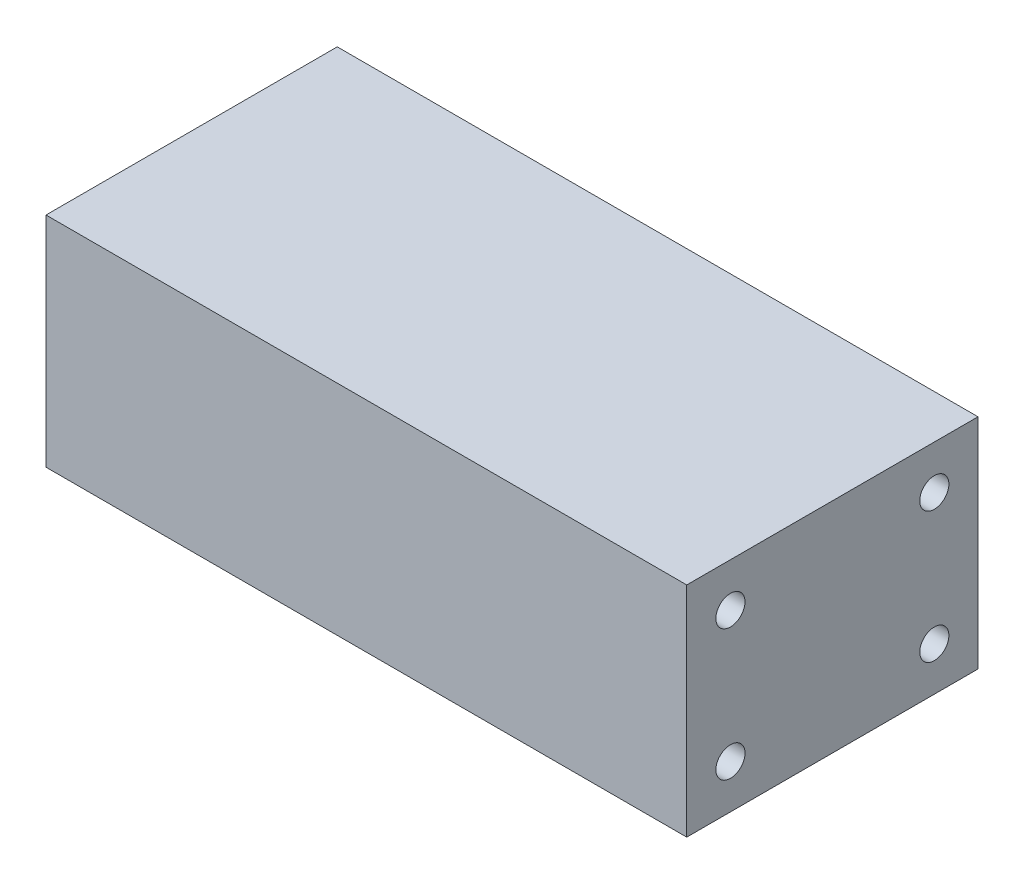
ISO-10303-21;
HEADER;
FILE_DESCRIPTION(('STEP AP214'),'2;1');
FILE_NAME('part.step','',(''),(''),'','','');
FILE_SCHEMA(('AUTOMOTIVE_DESIGN { 1 0 10303 214 1 1 1 1 }'));
ENDSEC;
DATA;
#1=APPLICATION_CONTEXT('core data for automotive mechanical design processes');
#2=APPLICATION_PROTOCOL_DEFINITION('international standard','automotive_design',2000,#1);
#3=PRODUCT_CONTEXT('',#1,'mechanical');
#4=PRODUCT('Part','Part','',(#3));
#5=PRODUCT_RELATED_PRODUCT_CATEGORY('part','',(#4));
#6=PRODUCT_DEFINITION_FORMATION('','',#4);
#7=PRODUCT_DEFINITION_CONTEXT('part definition',#1,'design');
#8=PRODUCT_DEFINITION('design','',#6,#7);
#9=PRODUCT_DEFINITION_SHAPE('','',#8);
#10=(LENGTH_UNIT() NAMED_UNIT(*) SI_UNIT(.MILLI.,.METRE.));
#11=(NAMED_UNIT(*) PLANE_ANGLE_UNIT() SI_UNIT($,.RADIAN.));
#12=(NAMED_UNIT(*) SI_UNIT($,.STERADIAN.) SOLID_ANGLE_UNIT());
#13=UNCERTAINTY_MEASURE_WITH_UNIT(LENGTH_MEASURE(1.E-05),#10,'distance_accuracy_value','');
#14=(GEOMETRIC_REPRESENTATION_CONTEXT(3) GLOBAL_UNCERTAINTY_ASSIGNED_CONTEXT((#13)) GLOBAL_UNIT_ASSIGNED_CONTEXT((#10,
#11,#12)) REPRESENTATION_CONTEXT('',''));
#15=CARTESIAN_POINT('',(0.,0.,0.));
#16=DIRECTION('',(0.,0.,1.));
#17=DIRECTION('',(1.,0.,0.));
#18=AXIS2_PLACEMENT_3D('',#15,#16,#17);
#19=CARTESIAN_POINT('',(-44.,0.,0.));
#20=DIRECTION('',(1.,0.,0.));
#21=DIRECTION('',(0.,0.,-1.));
#22=AXIS2_PLACEMENT_3D('',#19,#20,#21);
#23=PLANE('',#22);
#24=CARTESIAN_POINT('',(-44.,3.,-3.));
#25=DIRECTION('',(-1.,0.,0.));
#26=DIRECTION('',(0.,0.,1.));
#27=AXIS2_PLACEMENT_3D('',#24,#25,#26);
#28=CIRCLE('',#27,1.);
#29=CARTESIAN_POINT('',(-44.,3.,-2.));
#30=VERTEX_POINT('',#29);
#31=EDGE_CURVE('E182',#30,#30,#28,.T.);
#32=ORIENTED_EDGE('',*,*,#31,.F.);
#33=EDGE_LOOP('',(#32));
#34=FACE_BOUND('',#33,.T.);
#35=CARTESIAN_POINT('',(-44.,12.,-17.));
#36=DIRECTION('',(-1.,0.,0.));
#37=DIRECTION('',(0.,0.,1.));
#38=AXIS2_PLACEMENT_3D('',#35,#36,#37);
#39=CIRCLE('',#38,1.);
#40=CARTESIAN_POINT('',(-44.,12.,-16.));
#41=VERTEX_POINT('',#40);
#42=EDGE_CURVE('E170',#41,#41,#39,.T.);
#43=ORIENTED_EDGE('',*,*,#42,.F.);
#44=EDGE_LOOP('',(#43));
#45=FACE_BOUND('',#44,.T.);
#46=DIRECTION('',(0.,1.,0.));
#47=VECTOR('',#46,1.);
#48=CARTESIAN_POINT('',(-44.,0.,0.));
#49=LINE('',#48,#47);
#50=CARTESIAN_POINT('',(-44.,0.,0.));
#51=VERTEX_POINT('',#50);
#52=CARTESIAN_POINT('',(-44.,15.,0.));
#53=VERTEX_POINT('',#52);
#54=EDGE_CURVE('E92',#51,#53,#49,.T.);
#55=ORIENTED_EDGE('',*,*,#54,.T.);
#56=DIRECTION('',(0.,0.,-1.));
#57=VECTOR('',#56,1.);
#58=CARTESIAN_POINT('',(-44.,15.,0.));
#59=LINE('',#58,#57);
#60=CARTESIAN_POINT('',(-44.,15.,-20.));
#61=VERTEX_POINT('',#60);
#62=EDGE_CURVE('E50',#53,#61,#59,.T.);
#63=ORIENTED_EDGE('',*,*,#62,.T.);
#64=DIRECTION('',(0.,1.,0.));
#65=VECTOR('',#64,1.);
#66=CARTESIAN_POINT('',(-44.,0.,-20.));
#67=LINE('',#66,#65);
#68=CARTESIAN_POINT('',(-44.,0.,-20.));
#69=VERTEX_POINT('',#68);
#70=EDGE_CURVE('E83',#69,#61,#67,.T.);
#71=ORIENTED_EDGE('',*,*,#70,.F.);
#72=DIRECTION('',(0.,0.,-1.));
#73=VECTOR('',#72,1.);
#74=CARTESIAN_POINT('',(-44.,0.,0.));
#75=LINE('',#74,#73);
#76=EDGE_CURVE('E89',#51,#69,#75,.T.);
#77=ORIENTED_EDGE('',*,*,#76,.F.);
#78=EDGE_LOOP('',(#55,#63,#71,#77));
#79=FACE_BOUND('',#78,.T.);
#80=CARTESIAN_POINT('',(-44.,12.,-3.));
#81=DIRECTION('',(-1.,0.,0.));
#82=DIRECTION('',(0.,0.,1.));
#83=AXIS2_PLACEMENT_3D('',#80,#81,#82);
#84=CIRCLE('',#83,1.);
#85=CARTESIAN_POINT('',(-44.,12.,-2.));
#86=VERTEX_POINT('',#85);
#87=EDGE_CURVE('E188',#86,#86,#84,.F.);
#88=ORIENTED_EDGE('',*,*,#87,.T.);
#89=EDGE_LOOP('',(#88));
#90=FACE_BOUND('',#89,.T.);
#91=CARTESIAN_POINT('',(-44.,3.,-17.));
#92=DIRECTION('',(-1.,0.,0.));
#93=DIRECTION('',(0.,0.,1.));
#94=AXIS2_PLACEMENT_3D('',#91,#92,#93);
#95=CIRCLE('',#94,1.);
#96=CARTESIAN_POINT('',(-44.,3.,-16.));
#97=VERTEX_POINT('',#96);
#98=EDGE_CURVE('E176',#97,#97,#95,.F.);
#99=ORIENTED_EDGE('',*,*,#98,.T.);
#100=EDGE_LOOP('',(#99));
#101=FACE_BOUND('',#100,.T.);
#102=ADVANCED_FACE('F32',(#34,#45,#79,#90,#101),#23,.F.);
#103=CARTESIAN_POINT('',(0.,0.,0.));
#104=DIRECTION('',(1.,0.,0.));
#105=DIRECTION('',(0.,0.,-1.));
#106=AXIS2_PLACEMENT_3D('',#103,#104,#105);
#107=PLANE('',#106);
#108=CARTESIAN_POINT('',(0.,12.,-17.));
#109=DIRECTION('',(1.,0.,0.));
#110=DIRECTION('',(0.,0.,-1.));
#111=AXIS2_PLACEMENT_3D('',#108,#109,#110);
#112=CIRCLE('',#111,1.);
#113=CARTESIAN_POINT('',(0.,12.,-18.));
#114=VERTEX_POINT('',#113);
#115=EDGE_CURVE('E149',#114,#114,#112,.F.);
#116=ORIENTED_EDGE('',*,*,#115,.T.);
#117=EDGE_LOOP('',(#116));
#118=FACE_BOUND('',#117,.T.);
#119=CARTESIAN_POINT('',(0.,12.,-3.));
#120=DIRECTION('',(1.,0.,0.));
#121=DIRECTION('',(0.,0.,-1.));
#122=AXIS2_PLACEMENT_3D('',#119,#120,#121);
#123=CIRCLE('',#122,1.);
#124=CARTESIAN_POINT('',(0.,12.,-4.));
#125=VERTEX_POINT('',#124);
#126=EDGE_CURVE('E147',#125,#125,#123,.T.);
#127=ORIENTED_EDGE('',*,*,#126,.F.);
#128=EDGE_LOOP('',(#127));
#129=FACE_BOUND('',#128,.T.);
#130=DIRECTION('',(0.,1.,0.));
#131=VECTOR('',#130,1.);
#132=CARTESIAN_POINT('',(0.,0.,0.));
#133=LINE('',#132,#131);
#134=CARTESIAN_POINT('',(0.,0.,0.));
#135=VERTEX_POINT('',#134);
#136=CARTESIAN_POINT('',(0.,15.,0.));
#137=VERTEX_POINT('',#136);
#138=EDGE_CURVE('E98',#135,#137,#133,.T.);
#139=ORIENTED_EDGE('',*,*,#138,.F.);
#140=DIRECTION('',(0.,0.,-1.));
#141=VECTOR('',#140,1.);
#142=CARTESIAN_POINT('',(0.,0.,0.));
#143=LINE('',#142,#141);
#144=CARTESIAN_POINT('',(0.,0.,-20.));
#145=VERTEX_POINT('',#144);
#146=EDGE_CURVE('E101',#135,#145,#143,.T.);
#147=ORIENTED_EDGE('',*,*,#146,.T.);
#148=DIRECTION('',(0.,1.,0.));
#149=VECTOR('',#148,1.);
#150=CARTESIAN_POINT('',(0.,0.,-20.));
#151=LINE('',#150,#149);
#152=CARTESIAN_POINT('',(0.,15.,-20.));
#153=VERTEX_POINT('',#152);
#154=EDGE_CURVE('E84',#145,#153,#151,.T.);
#155=ORIENTED_EDGE('',*,*,#154,.T.);
#156=DIRECTION('',(0.,0.,-1.));
#157=VECTOR('',#156,1.);
#158=CARTESIAN_POINT('',(0.,15.,0.));
#159=LINE('',#158,#157);
#160=EDGE_CURVE('E72',#137,#153,#159,.T.);
#161=ORIENTED_EDGE('',*,*,#160,.F.);
#162=EDGE_LOOP('',(#139,#147,#155,#161));
#163=FACE_BOUND('',#162,.T.);
#164=CARTESIAN_POINT('',(0.,3.,-17.));
#165=DIRECTION('',(1.,0.,0.));
#166=DIRECTION('',(0.,0.,-1.));
#167=AXIS2_PLACEMENT_3D('',#164,#165,#166);
#168=CIRCLE('',#167,1.);
#169=CARTESIAN_POINT('',(0.,3.,-18.));
#170=VERTEX_POINT('',#169);
#171=EDGE_CURVE('E165',#170,#170,#168,.T.);
#172=ORIENTED_EDGE('',*,*,#171,.F.);
#173=EDGE_LOOP('',(#172));
#174=FACE_BOUND('',#173,.T.);
#175=CARTESIAN_POINT('',(0.,3.,-3.));
#176=DIRECTION('',(-1.,0.,0.));
#177=DIRECTION('',(0.,0.,1.));
#178=AXIS2_PLACEMENT_3D('',#175,#176,#177);
#179=CIRCLE('',#178,1.);
#180=CARTESIAN_POINT('',(0.,3.,-2.));
#181=VERTEX_POINT('',#180);
#182=EDGE_CURVE('E158',#181,#181,#179,.T.);
#183=ORIENTED_EDGE('',*,*,#182,.T.);
#184=EDGE_LOOP('',(#183));
#185=FACE_BOUND('',#184,.T.);
#186=ADVANCED_FACE('F108',(#118,#129,#163,#174,#185),#107,.T.);
#187=CARTESIAN_POINT('',(-44.,0.,0.));
#188=DIRECTION('',(0.,0.,-1.));
#189=DIRECTION('',(-1.,0.,0.));
#190=AXIS2_PLACEMENT_3D('',#187,#188,#189);
#191=PLANE('',#190);
#192=ORIENTED_EDGE('',*,*,#138,.T.);
#193=DIRECTION('',(1.,0.,0.));
#194=VECTOR('',#193,1.);
#195=CARTESIAN_POINT('',(-44.,15.,0.));
#196=LINE('',#195,#194);
#197=EDGE_CURVE('E11',#53,#137,#196,.T.);
#198=ORIENTED_EDGE('',*,*,#197,.F.);
#199=ORIENTED_EDGE('',*,*,#54,.F.);
#200=DIRECTION('',(1.,0.,0.));
#201=VECTOR('',#200,1.);
#202=CARTESIAN_POINT('',(-44.,0.,0.));
#203=LINE('',#202,#201);
#204=EDGE_CURVE('E36',#51,#135,#203,.T.);
#205=ORIENTED_EDGE('',*,*,#204,.T.);
#206=EDGE_LOOP('',(#192,#198,#199,#205));
#207=FACE_BOUND('',#206,.T.);
#208=ADVANCED_FACE('F34',(#207),#191,.F.);
#209=CARTESIAN_POINT('',(-44.,15.,0.));
#210=DIRECTION('',(0.,-1.,0.));
#211=DIRECTION('',(0.,0.,-1.));
#212=AXIS2_PLACEMENT_3D('',#209,#210,#211);
#213=PLANE('',#212);
#214=ORIENTED_EDGE('',*,*,#160,.T.);
#215=DIRECTION('',(1.,0.,0.));
#216=VECTOR('',#215,1.);
#217=CARTESIAN_POINT('',(-44.,15.,-20.));
#218=LINE('',#217,#216);
#219=EDGE_CURVE('E42',#61,#153,#218,.T.);
#220=ORIENTED_EDGE('',*,*,#219,.F.);
#221=ORIENTED_EDGE('',*,*,#62,.F.);
#222=ORIENTED_EDGE('',*,*,#197,.T.);
#223=EDGE_LOOP('',(#214,#220,#221,#222));
#224=FACE_BOUND('',#223,.T.);
#225=ADVANCED_FACE('F106',(#224),#213,.F.);
#226=CARTESIAN_POINT('',(-44.,0.,-20.));
#227=DIRECTION('',(0.,0.,-1.));
#228=DIRECTION('',(-1.,0.,0.));
#229=AXIS2_PLACEMENT_3D('',#226,#227,#228);
#230=PLANE('',#229);
#231=ORIENTED_EDGE('',*,*,#154,.F.);
#232=DIRECTION('',(1.,0.,0.));
#233=VECTOR('',#232,1.);
#234=CARTESIAN_POINT('',(-44.,0.,-20.));
#235=LINE('',#234,#233);
#236=EDGE_CURVE('E80',#69,#145,#235,.T.);
#237=ORIENTED_EDGE('',*,*,#236,.F.);
#238=ORIENTED_EDGE('',*,*,#70,.T.);
#239=ORIENTED_EDGE('',*,*,#219,.T.);
#240=EDGE_LOOP('',(#231,#237,#238,#239));
#241=FACE_BOUND('',#240,.T.);
#242=ADVANCED_FACE('F82',(#241),#230,.T.);
#243=CARTESIAN_POINT('',(-44.,0.,0.));
#244=DIRECTION('',(0.,-1.,0.));
#245=DIRECTION('',(0.,0.,-1.));
#246=AXIS2_PLACEMENT_3D('',#243,#244,#245);
#247=PLANE('',#246);
#248=ORIENTED_EDGE('',*,*,#146,.F.);
#249=ORIENTED_EDGE('',*,*,#204,.F.);
#250=ORIENTED_EDGE('',*,*,#76,.T.);
#251=ORIENTED_EDGE('',*,*,#236,.T.);
#252=EDGE_LOOP('',(#248,#249,#250,#251));
#253=FACE_BOUND('',#252,.T.);
#254=ADVANCED_FACE('F91',(#253),#247,.T.);
#255=CARTESIAN_POINT('',(-5.,12.,-3.));
#256=DIRECTION('',(1.,0.,0.));
#257=DIRECTION('',(0.,0.,-1.));
#258=AXIS2_PLACEMENT_3D('',#255,#256,#257);
#259=CYLINDRICAL_SURFACE('',#258,1.);
#260=CARTESIAN_POINT('',(-5.,12.,-3.));
#261=DIRECTION('',(1.,0.,0.));
#262=DIRECTION('',(0.,0.,-1.));
#263=AXIS2_PLACEMENT_3D('',#260,#261,#262);
#264=CIRCLE('',#263,1.);
#265=CARTESIAN_POINT('',(-5.,12.,-4.));
#266=VERTEX_POINT('',#265);
#267=EDGE_CURVE('E102',#266,#266,#264,.T.);
#268=ORIENTED_EDGE('',*,*,#267,.F.);
#269=EDGE_LOOP('',(#268));
#270=FACE_BOUND('',#269,.T.);
#271=ORIENTED_EDGE('',*,*,#126,.T.);
#272=EDGE_LOOP('',(#271));
#273=FACE_BOUND('',#272,.T.);
#274=ADVANCED_FACE('F127',(#270,#273),#259,.F.);
#275=CARTESIAN_POINT('',(-5.,0.,0.));
#276=DIRECTION('',(1.,0.,0.));
#277=DIRECTION('',(0.,0.,-1.));
#278=AXIS2_PLACEMENT_3D('',#275,#276,#277);
#279=PLANE('',#278);
#280=ORIENTED_EDGE('',*,*,#267,.T.);
#281=EDGE_LOOP('',(#280));
#282=FACE_BOUND('',#281,.T.);
#283=ADVANCED_FACE('F135',(#282),#279,.T.);
#284=CARTESIAN_POINT('',(-5.,12.,-17.));
#285=DIRECTION('',(1.,0.,0.));
#286=DIRECTION('',(0.,0.,-1.));
#287=AXIS2_PLACEMENT_3D('',#284,#285,#286);
#288=CYLINDRICAL_SURFACE('',#287,1.);
#289=CARTESIAN_POINT('',(-5.,12.,-17.));
#290=DIRECTION('',(1.,0.,0.));
#291=DIRECTION('',(0.,0.,-1.));
#292=AXIS2_PLACEMENT_3D('',#289,#290,#291);
#293=CIRCLE('',#292,1.);
#294=CARTESIAN_POINT('',(-5.,12.,-18.));
#295=VERTEX_POINT('',#294);
#296=EDGE_CURVE('E152',#295,#295,#293,.F.);
#297=ORIENTED_EDGE('',*,*,#296,.T.);
#298=EDGE_LOOP('',(#297));
#299=FACE_BOUND('',#298,.T.);
#300=ORIENTED_EDGE('',*,*,#115,.F.);
#301=EDGE_LOOP('',(#300));
#302=FACE_BOUND('',#301,.T.);
#303=ADVANCED_FACE('F140',(#299,#302),#288,.F.);
#304=CARTESIAN_POINT('',(-5.,0.,0.));
#305=DIRECTION('',(1.,0.,0.));
#306=DIRECTION('',(0.,0.,-1.));
#307=AXIS2_PLACEMENT_3D('',#304,#305,#306);
#308=PLANE('',#307);
#309=ORIENTED_EDGE('',*,*,#296,.F.);
#310=EDGE_LOOP('',(#309));
#311=FACE_BOUND('',#310,.T.);
#312=ADVANCED_FACE('F232',(#311),#308,.T.);
#313=CARTESIAN_POINT('',(-5.,3.,-17.));
#314=DIRECTION('',(1.,0.,0.));
#315=DIRECTION('',(0.,0.,-1.));
#316=AXIS2_PLACEMENT_3D('',#313,#314,#315);
#317=CYLINDRICAL_SURFACE('',#316,1.);
#318=CARTESIAN_POINT('',(-5.,3.,-17.));
#319=DIRECTION('',(1.,0.,0.));
#320=DIRECTION('',(0.,0.,-1.));
#321=AXIS2_PLACEMENT_3D('',#318,#319,#320);
#322=CIRCLE('',#321,1.);
#323=CARTESIAN_POINT('',(-5.,3.,-18.));
#324=VERTEX_POINT('',#323);
#325=EDGE_CURVE('E162',#324,#324,#322,.T.);
#326=ORIENTED_EDGE('',*,*,#325,.F.);
#327=EDGE_LOOP('',(#326));
#328=FACE_BOUND('',#327,.T.);
#329=ORIENTED_EDGE('',*,*,#171,.T.);
#330=EDGE_LOOP('',(#329));
#331=FACE_BOUND('',#330,.T.);
#332=ADVANCED_FACE('F236',(#328,#331),#317,.F.);
#333=CARTESIAN_POINT('',(-5.,0.,0.));
#334=DIRECTION('',(1.,0.,0.));
#335=DIRECTION('',(0.,0.,-1.));
#336=AXIS2_PLACEMENT_3D('',#333,#334,#335);
#337=PLANE('',#336);
#338=ORIENTED_EDGE('',*,*,#325,.T.);
#339=EDGE_LOOP('',(#338));
#340=FACE_BOUND('',#339,.T.);
#341=ADVANCED_FACE('F240',(#340),#337,.T.);
#342=CARTESIAN_POINT('',(-5.,3.,-3.));
#343=DIRECTION('',(1.,0.,0.));
#344=DIRECTION('',(0.,0.,-1.));
#345=AXIS2_PLACEMENT_3D('',#342,#343,#344);
#346=CYLINDRICAL_SURFACE('',#345,1.);
#347=CARTESIAN_POINT('',(-5.,3.,-3.));
#348=DIRECTION('',(-1.,0.,0.));
#349=DIRECTION('',(0.,0.,1.));
#350=AXIS2_PLACEMENT_3D('',#347,#348,#349);
#351=CIRCLE('',#350,1.);
#352=CARTESIAN_POINT('',(-5.,3.,-2.));
#353=VERTEX_POINT('',#352);
#354=EDGE_CURVE('E155',#353,#353,#351,.T.);
#355=ORIENTED_EDGE('',*,*,#354,.T.);
#356=EDGE_LOOP('',(#355));
#357=FACE_BOUND('',#356,.T.);
#358=ORIENTED_EDGE('',*,*,#182,.F.);
#359=EDGE_LOOP('',(#358));
#360=FACE_BOUND('',#359,.T.);
#361=ADVANCED_FACE('F244',(#357,#360),#346,.F.);
#362=CARTESIAN_POINT('',(-5.,3.,-3.));
#363=DIRECTION('',(-1.,0.,0.));
#364=DIRECTION('',(0.,0.,1.));
#365=AXIS2_PLACEMENT_3D('',#362,#363,#364);
#366=PLANE('',#365);
#367=ORIENTED_EDGE('',*,*,#354,.F.);
#368=EDGE_LOOP('',(#367));
#369=FACE_BOUND('',#368,.T.);
#370=ADVANCED_FACE('F228',(#369),#366,.F.);
#371=CARTESIAN_POINT('',(-39.,12.,-17.));
#372=DIRECTION('',(-1.,0.,0.));
#373=DIRECTION('',(0.,0.,1.));
#374=AXIS2_PLACEMENT_3D('',#371,#372,#373);
#375=CYLINDRICAL_SURFACE('',#374,1.);
#376=CARTESIAN_POINT('',(-39.,12.,-17.));
#377=DIRECTION('',(-1.,0.,0.));
#378=DIRECTION('',(0.,0.,1.));
#379=AXIS2_PLACEMENT_3D('',#376,#377,#378);
#380=CIRCLE('',#379,1.);
#381=CARTESIAN_POINT('',(-39.,12.,-16.));
#382=VERTEX_POINT('',#381);
#383=EDGE_CURVE('E159',#382,#382,#380,.T.);
#384=ORIENTED_EDGE('',*,*,#383,.F.);
#385=EDGE_LOOP('',(#384));
#386=FACE_BOUND('',#385,.T.);
#387=ORIENTED_EDGE('',*,*,#42,.T.);
#388=EDGE_LOOP('',(#387));
#389=FACE_BOUND('',#388,.T.);
#390=ADVANCED_FACE('F224',(#386,#389),#375,.F.);
#391=CARTESIAN_POINT('',(-39.,0.,0.));
#392=DIRECTION('',(-1.,0.,0.));
#393=DIRECTION('',(0.,0.,1.));
#394=AXIS2_PLACEMENT_3D('',#391,#392,#393);
#395=PLANE('',#394);
#396=ORIENTED_EDGE('',*,*,#383,.T.);
#397=EDGE_LOOP('',(#396));
#398=FACE_BOUND('',#397,.T.);
#399=ADVANCED_FACE('F208',(#398),#395,.T.);
#400=CARTESIAN_POINT('',(-39.,12.,-3.));
#401=DIRECTION('',(-1.,0.,0.));
#402=DIRECTION('',(0.,0.,1.));
#403=AXIS2_PLACEMENT_3D('',#400,#401,#402);
#404=CYLINDRICAL_SURFACE('',#403,1.);
#405=CARTESIAN_POINT('',(-39.,12.,-3.));
#406=DIRECTION('',(-1.,0.,0.));
#407=DIRECTION('',(0.,0.,1.));
#408=AXIS2_PLACEMENT_3D('',#405,#406,#407);
#409=CIRCLE('',#408,1.);
#410=CARTESIAN_POINT('',(-39.,12.,-2.));
#411=VERTEX_POINT('',#410);
#412=EDGE_CURVE('E173',#411,#411,#409,.F.);
#413=ORIENTED_EDGE('',*,*,#412,.T.);
#414=EDGE_LOOP('',(#413));
#415=FACE_BOUND('',#414,.T.);
#416=ORIENTED_EDGE('',*,*,#87,.F.);
#417=EDGE_LOOP('',(#416));
#418=FACE_BOUND('',#417,.T.);
#419=ADVANCED_FACE('F194',(#415,#418),#404,.F.);
#420=CARTESIAN_POINT('',(-39.,0.,0.));
#421=DIRECTION('',(-1.,0.,0.));
#422=DIRECTION('',(0.,0.,1.));
#423=AXIS2_PLACEMENT_3D('',#420,#421,#422);
#424=PLANE('',#423);
#425=ORIENTED_EDGE('',*,*,#412,.F.);
#426=EDGE_LOOP('',(#425));
#427=FACE_BOUND('',#426,.T.);
#428=ADVANCED_FACE('F197',(#427),#424,.T.);
#429=CARTESIAN_POINT('',(-39.,3.,-3.));
#430=DIRECTION('',(-1.,0.,0.));
#431=DIRECTION('',(0.,0.,1.));
#432=AXIS2_PLACEMENT_3D('',#429,#430,#431);
#433=CYLINDRICAL_SURFACE('',#432,1.);
#434=CARTESIAN_POINT('',(-39.,3.,-3.));
#435=DIRECTION('',(-1.,0.,0.));
#436=DIRECTION('',(0.,0.,1.));
#437=AXIS2_PLACEMENT_3D('',#434,#435,#436);
#438=CIRCLE('',#437,1.);
#439=CARTESIAN_POINT('',(-39.,3.,-2.));
#440=VERTEX_POINT('',#439);
#441=EDGE_CURVE('E185',#440,#440,#438,.T.);
#442=ORIENTED_EDGE('',*,*,#441,.F.);
#443=EDGE_LOOP('',(#442));
#444=FACE_BOUND('',#443,.T.);
#445=ORIENTED_EDGE('',*,*,#31,.T.);
#446=EDGE_LOOP('',(#445));
#447=FACE_BOUND('',#446,.T.);
#448=ADVANCED_FACE('F199',(#444,#447),#433,.F.);
#449=CARTESIAN_POINT('',(-39.,0.,0.));
#450=DIRECTION('',(-1.,0.,0.));
#451=DIRECTION('',(0.,0.,1.));
#452=AXIS2_PLACEMENT_3D('',#449,#450,#451);
#453=PLANE('',#452);
#454=ORIENTED_EDGE('',*,*,#441,.T.);
#455=EDGE_LOOP('',(#454));
#456=FACE_BOUND('',#455,.T.);
#457=ADVANCED_FACE('F205',(#456),#453,.T.);
#458=CARTESIAN_POINT('',(-39.,3.,-17.));
#459=DIRECTION('',(-1.,0.,0.));
#460=DIRECTION('',(0.,0.,1.));
#461=AXIS2_PLACEMENT_3D('',#458,#459,#460);
#462=CYLINDRICAL_SURFACE('',#461,1.);
#463=CARTESIAN_POINT('',(-39.,3.,-17.));
#464=DIRECTION('',(-1.,0.,0.));
#465=DIRECTION('',(0.,0.,1.));
#466=AXIS2_PLACEMENT_3D('',#463,#464,#465);
#467=CIRCLE('',#466,1.);
#468=CARTESIAN_POINT('',(-39.,3.,-16.));
#469=VERTEX_POINT('',#468);
#470=EDGE_CURVE('E179',#469,#469,#467,.F.);
#471=ORIENTED_EDGE('',*,*,#470,.T.);
#472=EDGE_LOOP('',(#471));
#473=FACE_BOUND('',#472,.T.);
#474=ORIENTED_EDGE('',*,*,#98,.F.);
#475=EDGE_LOOP('',(#474));
#476=FACE_BOUND('',#475,.T.);
#477=ADVANCED_FACE('F212',(#473,#476),#462,.F.);
#478=CARTESIAN_POINT('',(-39.,0.,0.));
#479=DIRECTION('',(-1.,0.,0.));
#480=DIRECTION('',(0.,0.,1.));
#481=AXIS2_PLACEMENT_3D('',#478,#479,#480);
#482=PLANE('',#481);
#483=ORIENTED_EDGE('',*,*,#470,.F.);
#484=EDGE_LOOP('',(#483));
#485=FACE_BOUND('',#484,.T.);
#486=ADVANCED_FACE('F215',(#485),#482,.T.);
#487=CLOSED_SHELL('',(#102,#186,#208,#225,#242,#254,#274,#283,#303,#312,#332,#341,#361,#370,
#390,#399,#419,#428,#448,#457,#477,#486));
#488=MANIFOLD_SOLID_BREP('B2',#487);
#489=ADVANCED_BREP_SHAPE_REPRESENTATION('',(#18,#488),#14);
#490=SHAPE_DEFINITION_REPRESENTATION(#9,#489);
ENDSEC;
END-ISO-10303-21;
